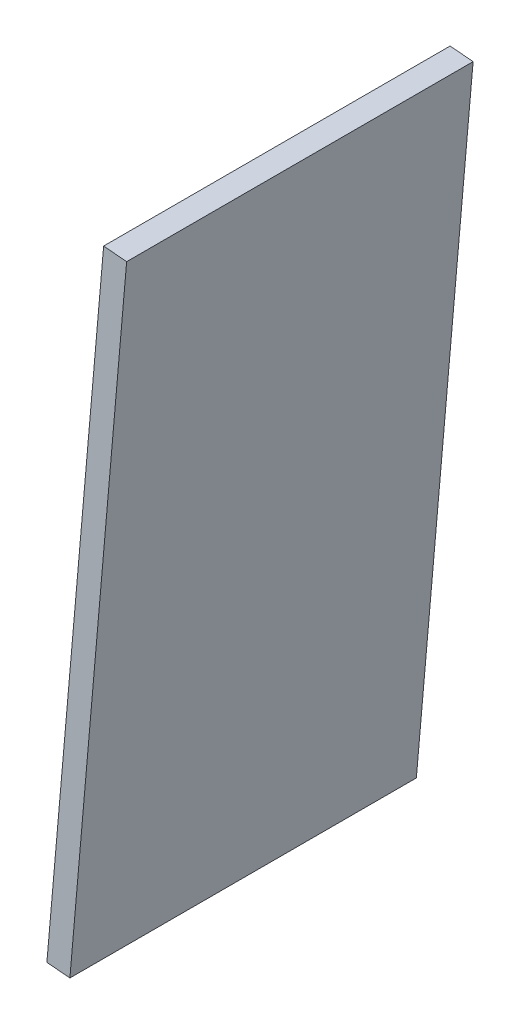
ISO-10303-21;
HEADER;
FILE_DESCRIPTION(('STEP AP214'),'2;1');
FILE_NAME('part.step','',(''),(''),'','','');
FILE_SCHEMA(('AUTOMOTIVE_DESIGN { 1 0 10303 214 1 1 1 1 }'));
ENDSEC;
DATA;
#1=APPLICATION_CONTEXT('core data for automotive mechanical design processes');
#2=APPLICATION_PROTOCOL_DEFINITION('international standard','automotive_design',2000,#1);
#3=PRODUCT_CONTEXT('',#1,'mechanical');
#4=PRODUCT('Part','Part','',(#3));
#5=PRODUCT_RELATED_PRODUCT_CATEGORY('part','',(#4));
#6=PRODUCT_DEFINITION_FORMATION('','',#4);
#7=PRODUCT_DEFINITION_CONTEXT('part definition',#1,'design');
#8=PRODUCT_DEFINITION('design','',#6,#7);
#9=PRODUCT_DEFINITION_SHAPE('','',#8);
#10=(LENGTH_UNIT() NAMED_UNIT(*) SI_UNIT(.MILLI.,.METRE.));
#11=(NAMED_UNIT(*) PLANE_ANGLE_UNIT() SI_UNIT($,.RADIAN.));
#12=(NAMED_UNIT(*) SI_UNIT($,.STERADIAN.) SOLID_ANGLE_UNIT());
#13=UNCERTAINTY_MEASURE_WITH_UNIT(LENGTH_MEASURE(1.E-05),#10,'distance_accuracy_value','');
#14=(GEOMETRIC_REPRESENTATION_CONTEXT(3) GLOBAL_UNCERTAINTY_ASSIGNED_CONTEXT((#13)) GLOBAL_UNIT_ASSIGNED_CONTEXT((#10,
#11,#12)) REPRESENTATION_CONTEXT('',''));
#15=CARTESIAN_POINT('',(0.,0.,0.));
#16=DIRECTION('',(0.,0.,1.));
#17=DIRECTION('',(1.,0.,0.));
#18=AXIS2_PLACEMENT_3D('',#15,#16,#17);
#19=CARTESIAN_POINT('',(38.5430041204421,0.531650030760758,95.25));
#20=DIRECTION('',(0.996194698091745,-0.0871557427476619,0.));
#21=DIRECTION('',(0.0871557427476619,0.996194698091745,0.));
#22=AXIS2_PLACEMENT_3D('',#19,#20,#21);
#23=PLANE('',#22);
#24=DIRECTION('',(-0.0871557427476619,-0.996194698091745,0.));
#25=VECTOR('',#24,1.);
#26=CARTESIAN_POINT('',(38.5430041204421,0.531650030760758,0.));
#27=LINE('',#26,#25);
#28=CARTESIAN_POINT('',(54.1467714158658,178.883526337563,0.));
#29=VERTEX_POINT('',#28);
#30=CARTESIAN_POINT('',(38.5430041204421,0.531650030760758,0.));
#31=VERTEX_POINT('',#30);
#32=EDGE_CURVE('E96',#29,#31,#27,.T.);
#33=ORIENTED_EDGE('',*,*,#32,.T.);
#34=DIRECTION('',(0.,0.,-1.));
#35=VECTOR('',#34,1.);
#36=CARTESIAN_POINT('',(38.5430041204421,0.531650030760758,95.25));
#37=LINE('',#36,#35);
#38=CARTESIAN_POINT('',(38.5430041204421,0.531650030760758,95.25));
#39=VERTEX_POINT('',#38);
#40=EDGE_CURVE('E11',#39,#31,#37,.T.);
#41=ORIENTED_EDGE('',*,*,#40,.F.);
#42=DIRECTION('',(-0.0871557427476619,-0.996194698091745,0.));
#43=VECTOR('',#42,1.);
#44=CARTESIAN_POINT('',(38.5430041204421,0.531650030760758,95.25));
#45=LINE('',#44,#43);
#46=CARTESIAN_POINT('',(54.1467714158658,178.883526337563,95.25));
#47=VERTEX_POINT('',#46);
#48=EDGE_CURVE('E84',#47,#39,#45,.T.);
#49=ORIENTED_EDGE('',*,*,#48,.F.);
#50=DIRECTION('',(0.,0.,-1.));
#51=VECTOR('',#50,1.);
#52=CARTESIAN_POINT('',(54.1467714158658,178.883526337563,95.25));
#53=LINE('',#52,#51);
#54=EDGE_CURVE('E92',#47,#29,#53,.T.);
#55=ORIENTED_EDGE('',*,*,#54,.T.);
#56=EDGE_LOOP('',(#33,#41,#49,#55));
#57=FACE_BOUND('',#56,.T.);
#58=ADVANCED_FACE('F33',(#57),#23,.F.);
#59=CARTESIAN_POINT('',(38.5430041204421,0.531650030760758,95.25));
#60=DIRECTION('',(0.0871557427476619,0.996194698091745,0.));
#61=DIRECTION('',(-0.996194698091745,0.0871557427476619,0.));
#62=AXIS2_PLACEMENT_3D('',#59,#60,#61);
#63=PLANE('',#62);
#64=DIRECTION('',(0.996194698091745,-0.0871557427476619,0.));
#65=VECTOR('',#64,1.);
#66=CARTESIAN_POINT('',(38.5430041204421,0.531650030760758,0.));
#67=LINE('',#66,#65);
#68=CARTESIAN_POINT('',(44.8688404533247,-0.0217889356868956,0.));
#69=VERTEX_POINT('',#68);
#70=EDGE_CURVE('E88',#31,#69,#67,.T.);
#71=ORIENTED_EDGE('',*,*,#70,.T.);
#72=DIRECTION('',(0.,0.,-1.));
#73=VECTOR('',#72,1.);
#74=CARTESIAN_POINT('',(44.8688404533247,-0.0217889356868956,95.25));
#75=LINE('',#74,#73);
#76=CARTESIAN_POINT('',(44.8688404533247,-0.0217889356868956,95.25));
#77=VERTEX_POINT('',#76);
#78=EDGE_CURVE('E41',#77,#69,#75,.T.);
#79=ORIENTED_EDGE('',*,*,#78,.F.);
#80=DIRECTION('',(0.996194698091745,-0.0871557427476619,0.));
#81=VECTOR('',#80,1.);
#82=CARTESIAN_POINT('',(38.5430041204421,0.531650030760758,95.25));
#83=LINE('',#82,#81);
#84=EDGE_CURVE('E79',#39,#77,#83,.T.);
#85=ORIENTED_EDGE('',*,*,#84,.F.);
#86=ORIENTED_EDGE('',*,*,#40,.T.);
#87=EDGE_LOOP('',(#71,#79,#85,#86));
#88=FACE_BOUND('',#87,.T.);
#89=ADVANCED_FACE('F87',(#88),#63,.F.);
#90=CARTESIAN_POINT('',(44.8688404533247,-0.0217889356868956,95.25));
#91=DIRECTION('',(-0.996194698091745,0.0871557427476617,0.));
#92=DIRECTION('',(-0.0871557427476617,-0.996194698091745,0.));
#93=AXIS2_PLACEMENT_3D('',#90,#91,#92);
#94=PLANE('',#93);
#95=DIRECTION('',(0.0871557427476616,0.996194698091745,0.));
#96=VECTOR('',#95,1.);
#97=CARTESIAN_POINT('',(44.8688404533247,-0.0217889356868956,0.));
#98=LINE('',#97,#96);
#99=CARTESIAN_POINT('',(60.4726077487484,178.330087371115,0.));
#100=VERTEX_POINT('',#99);
#101=EDGE_CURVE('E66',#69,#100,#98,.T.);
#102=ORIENTED_EDGE('',*,*,#101,.T.);
#103=DIRECTION('',(0.,0.,-1.));
#104=VECTOR('',#103,1.);
#105=CARTESIAN_POINT('',(60.4726077487484,178.330087371115,95.25));
#106=LINE('',#105,#104);
#107=CARTESIAN_POINT('',(60.4726077487484,178.330087371115,95.25));
#108=VERTEX_POINT('',#107);
#109=EDGE_CURVE('E89',#108,#100,#106,.T.);
#110=ORIENTED_EDGE('',*,*,#109,.F.);
#111=DIRECTION('',(0.0871557427476616,0.996194698091745,0.));
#112=VECTOR('',#111,1.);
#113=CARTESIAN_POINT('',(44.8688404533247,-0.0217889356868956,95.25));
#114=LINE('',#113,#112);
#115=EDGE_CURVE('E82',#77,#108,#114,.T.);
#116=ORIENTED_EDGE('',*,*,#115,.F.);
#117=ORIENTED_EDGE('',*,*,#78,.T.);
#118=EDGE_LOOP('',(#102,#110,#116,#117));
#119=FACE_BOUND('',#118,.T.);
#120=ADVANCED_FACE('F90',(#119),#94,.F.);
#121=CARTESIAN_POINT('',(54.1467714158658,178.883526337563,95.25));
#122=DIRECTION('',(-0.0871557427476637,-0.996194698091745,0.));
#123=DIRECTION('',(0.996194698091745,-0.0871557427476637,0.));
#124=AXIS2_PLACEMENT_3D('',#121,#122,#123);
#125=PLANE('',#124);
#126=DIRECTION('',(-0.996194698091745,0.0871557427476637,0.));
#127=VECTOR('',#126,1.);
#128=CARTESIAN_POINT('',(54.1467714158658,178.883526337563,0.));
#129=LINE('',#128,#127);
#130=EDGE_CURVE('E72',#100,#29,#129,.T.);
#131=ORIENTED_EDGE('',*,*,#130,.T.);
#132=ORIENTED_EDGE('',*,*,#54,.F.);
#133=DIRECTION('',(-0.996194698091745,0.0871557427476637,0.));
#134=VECTOR('',#133,1.);
#135=CARTESIAN_POINT('',(54.1467714158658,178.883526337563,95.25));
#136=LINE('',#135,#134);
#137=EDGE_CURVE('E49',#108,#47,#136,.T.);
#138=ORIENTED_EDGE('',*,*,#137,.F.);
#139=ORIENTED_EDGE('',*,*,#109,.T.);
#140=EDGE_LOOP('',(#131,#132,#138,#139));
#141=FACE_BOUND('',#140,.T.);
#142=ADVANCED_FACE('F103',(#141),#125,.F.);
#143=CARTESIAN_POINT('',(0.,0.,95.25));
#144=DIRECTION('',(0.,0.,-1.));
#145=DIRECTION('',(-1.,0.,0.));
#146=AXIS2_PLACEMENT_3D('',#143,#144,#145);
#147=PLANE('',#146);
#148=ORIENTED_EDGE('',*,*,#48,.T.);
#149=ORIENTED_EDGE('',*,*,#84,.T.);
#150=ORIENTED_EDGE('',*,*,#115,.T.);
#151=ORIENTED_EDGE('',*,*,#137,.T.);
#152=EDGE_LOOP('',(#148,#149,#150,#151));
#153=FACE_BOUND('',#152,.T.);
#154=ADVANCED_FACE('F80',(#153),#147,.F.);
#155=CARTESIAN_POINT('',(0.,0.,0.));
#156=DIRECTION('',(0.,0.,-1.));
#157=DIRECTION('',(-1.,0.,0.));
#158=AXIS2_PLACEMENT_3D('',#155,#156,#157);
#159=PLANE('',#158);
#160=ORIENTED_EDGE('',*,*,#32,.F.);
#161=ORIENTED_EDGE('',*,*,#130,.F.);
#162=ORIENTED_EDGE('',*,*,#101,.F.);
#163=ORIENTED_EDGE('',*,*,#70,.F.);
#164=EDGE_LOOP('',(#160,#161,#162,#163));
#165=FACE_BOUND('',#164,.T.);
#166=ADVANCED_FACE('F106',(#165),#159,.T.);
#167=CLOSED_SHELL('',(#58,#89,#120,#142,#154,#166));
#168=MANIFOLD_SOLID_BREP('B2',#167);
#169=ADVANCED_BREP_SHAPE_REPRESENTATION('',(#18,#168),#14);
#170=SHAPE_DEFINITION_REPRESENTATION(#9,#169);
ENDSEC;
END-ISO-10303-21;
